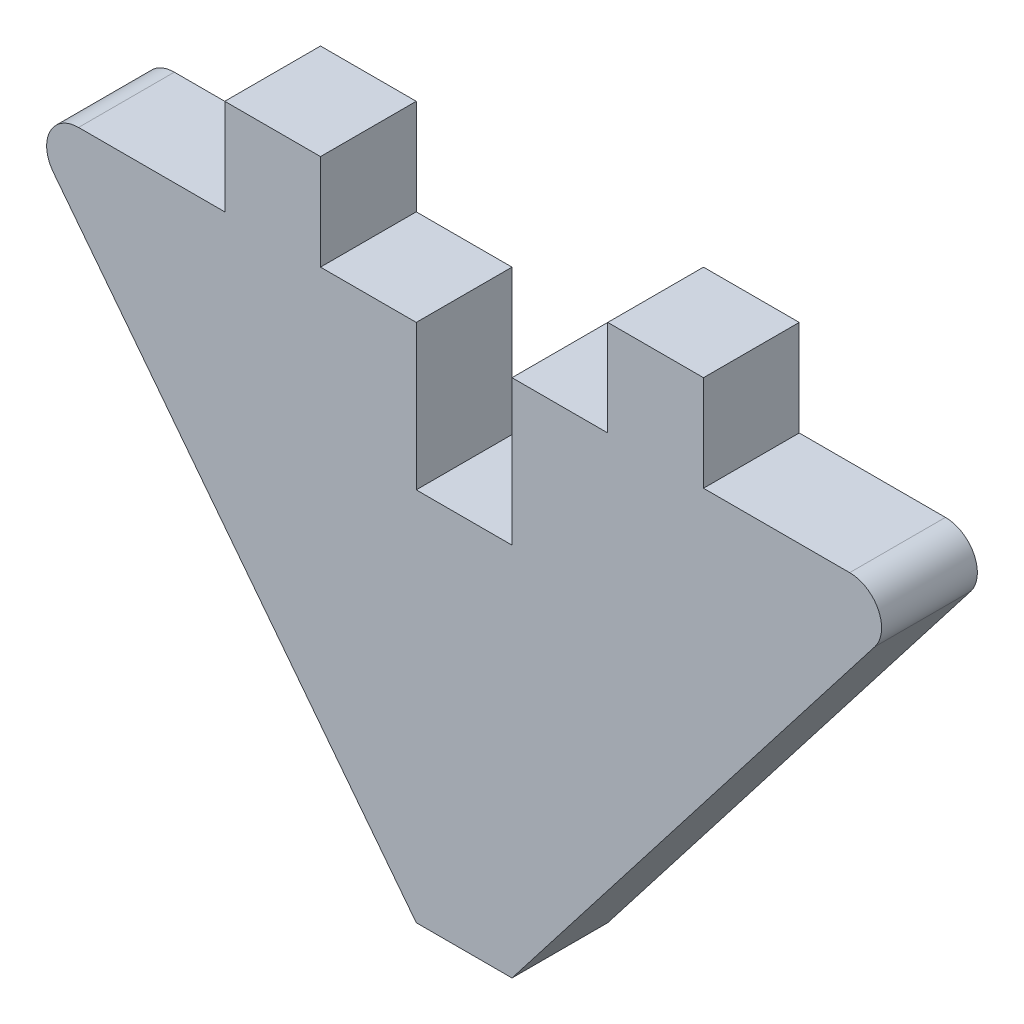
ISO-10303-21;
HEADER;
FILE_DESCRIPTION(('STEP AP214'),'2;1');
FILE_NAME('part.step','',(''),(''),'','','');
FILE_SCHEMA(('AUTOMOTIVE_DESIGN { 1 0 10303 214 1 1 1 1 }'));
ENDSEC;
DATA;
#1=APPLICATION_CONTEXT('core data for automotive mechanical design processes');
#2=APPLICATION_PROTOCOL_DEFINITION('international standard','automotive_design',2000,#1);
#3=PRODUCT_CONTEXT('',#1,'mechanical');
#4=PRODUCT('Part','Part','',(#3));
#5=PRODUCT_RELATED_PRODUCT_CATEGORY('part','',(#4));
#6=PRODUCT_DEFINITION_FORMATION('','',#4);
#7=PRODUCT_DEFINITION_CONTEXT('part definition',#1,'design');
#8=PRODUCT_DEFINITION('design','',#6,#7);
#9=PRODUCT_DEFINITION_SHAPE('','',#8);
#10=(LENGTH_UNIT() NAMED_UNIT(*) SI_UNIT(.MILLI.,.METRE.));
#11=(NAMED_UNIT(*) PLANE_ANGLE_UNIT() SI_UNIT($,.RADIAN.));
#12=(NAMED_UNIT(*) SI_UNIT($,.STERADIAN.) SOLID_ANGLE_UNIT());
#13=UNCERTAINTY_MEASURE_WITH_UNIT(LENGTH_MEASURE(1.E-05),#10,'distance_accuracy_value','');
#14=(GEOMETRIC_REPRESENTATION_CONTEXT(3) GLOBAL_UNCERTAINTY_ASSIGNED_CONTEXT((#13)) GLOBAL_UNIT_ASSIGNED_CONTEXT((#10,
#11,#12)) REPRESENTATION_CONTEXT('',''));
#15=CARTESIAN_POINT('',(0.,0.,0.));
#16=DIRECTION('',(0.,0.,1.));
#17=DIRECTION('',(1.,0.,0.));
#18=AXIS2_PLACEMENT_3D('',#15,#16,#17);
#19=CARTESIAN_POINT('',(1.524,62.1762102271489,1.524));
#20=DIRECTION('',(0.,-1.,0.));
#21=DIRECTION('',(0.,0.,-1.));
#22=AXIS2_PLACEMENT_3D('',#19,#20,#21);
#23=PLANE('',#22);
#24=DIRECTION('',(-1.,0.,0.));
#25=VECTOR('',#24,1.);
#26=CARTESIAN_POINT('',(1.524,62.1762102271489,0.));
#27=LINE('',#26,#25);
#28=CARTESIAN_POINT('',(1.524,62.1762102271489,0.));
#29=VERTEX_POINT('',#28);
#30=CARTESIAN_POINT('',(0.,62.1762102271489,0.));
#31=VERTEX_POINT('',#30);
#32=EDGE_CURVE('E188',#29,#31,#27,.T.);
#33=ORIENTED_EDGE('',*,*,#32,.T.);
#34=DIRECTION('',(0.,0.,-1.));
#35=VECTOR('',#34,1.);
#36=CARTESIAN_POINT('',(0.,62.1762102271489,1.524));
#37=LINE('',#36,#35);
#38=CARTESIAN_POINT('',(0.,62.1762102271489,1.524));
#39=VERTEX_POINT('',#38);
#40=EDGE_CURVE('E11',#39,#31,#37,.T.);
#41=ORIENTED_EDGE('',*,*,#40,.F.);
#42=DIRECTION('',(-1.,0.,0.));
#43=VECTOR('',#42,1.);
#44=CARTESIAN_POINT('',(1.524,62.1762102271489,1.524));
#45=LINE('',#44,#43);
#46=CARTESIAN_POINT('',(1.524,62.1762102271489,1.524));
#47=VERTEX_POINT('',#46);
#48=EDGE_CURVE('E222',#47,#39,#45,.T.);
#49=ORIENTED_EDGE('',*,*,#48,.F.);
#50=DIRECTION('',(0.,0.,-1.));
#51=VECTOR('',#50,1.);
#52=CARTESIAN_POINT('',(1.524,62.1762102271489,1.524));
#53=LINE('',#52,#51);
#54=EDGE_CURVE('E184',#47,#29,#53,.T.);
#55=ORIENTED_EDGE('',*,*,#54,.T.);
#56=EDGE_LOOP('',(#33,#41,#49,#55));
#57=FACE_BOUND('',#56,.T.);
#58=ADVANCED_FACE('F32',(#57),#23,.F.);
#59=CARTESIAN_POINT('',(0.,62.1762102271489,1.524));
#60=DIRECTION('',(-1.,0.,0.));
#61=DIRECTION('',(0.,0.,1.));
#62=AXIS2_PLACEMENT_3D('',#59,#60,#61);
#63=PLANE('',#62);
#64=DIRECTION('',(0.,1.,0.));
#65=VECTOR('',#64,1.);
#66=CARTESIAN_POINT('',(0.,62.1762102271489,0.));
#67=LINE('',#66,#65);
#68=CARTESIAN_POINT('',(0.,64.484455760315,0.));
#69=VERTEX_POINT('',#68);
#70=EDGE_CURVE('E191',#31,#69,#67,.T.);
#71=ORIENTED_EDGE('',*,*,#70,.T.);
#72=DIRECTION('',(0.,0.,-1.));
#73=VECTOR('',#72,1.);
#74=CARTESIAN_POINT('',(0.,64.484455760315,1.524));
#75=LINE('',#74,#73);
#76=CARTESIAN_POINT('',(0.,64.484455760315,1.524));
#77=VERTEX_POINT('',#76);
#78=EDGE_CURVE('E40',#77,#69,#75,.T.);
#79=ORIENTED_EDGE('',*,*,#78,.F.);
#80=DIRECTION('',(0.,1.,0.));
#81=VECTOR('',#80,1.);
#82=CARTESIAN_POINT('',(0.,62.1762102271489,1.524));
#83=LINE('',#82,#81);
#84=EDGE_CURVE('E121',#39,#77,#83,.T.);
#85=ORIENTED_EDGE('',*,*,#84,.F.);
#86=ORIENTED_EDGE('',*,*,#40,.T.);
#87=EDGE_LOOP('',(#71,#79,#85,#86));
#88=FACE_BOUND('',#87,.T.);
#89=ADVANCED_FACE('F330',(#88),#63,.F.);
#90=CARTESIAN_POINT('',(0.,64.484455760315,1.524));
#91=DIRECTION('',(0.,-1.,0.));
#92=DIRECTION('',(0.,0.,-1.));
#93=AXIS2_PLACEMENT_3D('',#90,#91,#92);
#94=PLANE('',#93);
#95=DIRECTION('',(-1.,0.,0.));
#96=VECTOR('',#95,1.);
#97=CARTESIAN_POINT('',(0.,64.484455760315,0.));
#98=LINE('',#97,#96);
#99=CARTESIAN_POINT('',(-1.524,64.484455760315,0.));
#100=VERTEX_POINT('',#99);
#101=EDGE_CURVE('E193',#69,#100,#98,.T.);
#102=ORIENTED_EDGE('',*,*,#101,.T.);
#103=DIRECTION('',(0.,0.,-1.));
#104=VECTOR('',#103,1.);
#105=CARTESIAN_POINT('',(-1.524,64.484455760315,1.524));
#106=LINE('',#105,#104);
#107=CARTESIAN_POINT('',(-1.524,64.484455760315,1.524));
#108=VERTEX_POINT('',#107);
#109=EDGE_CURVE('E259',#108,#100,#106,.T.);
#110=ORIENTED_EDGE('',*,*,#109,.F.);
#111=DIRECTION('',(-1.,0.,0.));
#112=VECTOR('',#111,1.);
#113=CARTESIAN_POINT('',(0.,64.484455760315,1.524));
#114=LINE('',#113,#112);
#115=EDGE_CURVE('E267',#77,#108,#114,.T.);
#116=ORIENTED_EDGE('',*,*,#115,.F.);
#117=ORIENTED_EDGE('',*,*,#78,.T.);
#118=EDGE_LOOP('',(#102,#110,#116,#117));
#119=FACE_BOUND('',#118,.T.);
#120=ADVANCED_FACE('F265',(#119),#94,.F.);
#121=CARTESIAN_POINT('',(-1.524,64.484455760315,1.524));
#122=DIRECTION('',(-1.,0.,0.));
#123=DIRECTION('',(0.,0.,1.));
#124=AXIS2_PLACEMENT_3D('',#121,#122,#123);
#125=PLANE('',#124);
#126=DIRECTION('',(0.,1.,0.));
#127=VECTOR('',#126,1.);
#128=CARTESIAN_POINT('',(-1.524,64.484455760315,0.));
#129=LINE('',#128,#127);
#130=CARTESIAN_POINT('',(-1.524,66.008455760315,0.));
#131=VERTEX_POINT('',#130);
#132=EDGE_CURVE('E195',#100,#131,#129,.T.);
#133=ORIENTED_EDGE('',*,*,#132,.T.);
#134=DIRECTION('',(0.,0.,-1.));
#135=VECTOR('',#134,1.);
#136=CARTESIAN_POINT('',(-1.524,66.008455760315,1.524));
#137=LINE('',#136,#135);
#138=CARTESIAN_POINT('',(-1.524,66.008455760315,1.524));
#139=VERTEX_POINT('',#138);
#140=EDGE_CURVE('E256',#139,#131,#137,.T.);
#141=ORIENTED_EDGE('',*,*,#140,.F.);
#142=DIRECTION('',(0.,1.,0.));
#143=VECTOR('',#142,1.);
#144=CARTESIAN_POINT('',(-1.524,64.484455760315,1.524));
#145=LINE('',#144,#143);
#146=EDGE_CURVE('E285',#108,#139,#145,.T.);
#147=ORIENTED_EDGE('',*,*,#146,.F.);
#148=ORIENTED_EDGE('',*,*,#109,.T.);
#149=EDGE_LOOP('',(#133,#141,#147,#148));
#150=FACE_BOUND('',#149,.T.);
#151=ADVANCED_FACE('F276',(#150),#125,.F.);
#152=CARTESIAN_POINT('',(-1.524,66.008455760315,1.524));
#153=DIRECTION('',(0.,-1.,0.));
#154=DIRECTION('',(0.,0.,-1.));
#155=AXIS2_PLACEMENT_3D('',#152,#153,#154);
#156=PLANE('',#155);
#157=DIRECTION('',(-1.,0.,0.));
#158=VECTOR('',#157,1.);
#159=CARTESIAN_POINT('',(-1.524,66.008455760315,0.));
#160=LINE('',#159,#158);
#161=CARTESIAN_POINT('',(-3.048,66.008455760315,0.));
#162=VERTEX_POINT('',#161);
#163=EDGE_CURVE('E197',#131,#162,#160,.T.);
#164=ORIENTED_EDGE('',*,*,#163,.T.);
#165=DIRECTION('',(0.,0.,-1.));
#166=VECTOR('',#165,1.);
#167=CARTESIAN_POINT('',(-3.048,66.008455760315,1.524));
#168=LINE('',#167,#166);
#169=CARTESIAN_POINT('',(-3.048,66.008455760315,1.524));
#170=VERTEX_POINT('',#169);
#171=EDGE_CURVE('E253',#170,#162,#168,.T.);
#172=ORIENTED_EDGE('',*,*,#171,.F.);
#173=DIRECTION('',(-1.,0.,0.));
#174=VECTOR('',#173,1.);
#175=CARTESIAN_POINT('',(-1.524,66.008455760315,1.524));
#176=LINE('',#175,#174);
#177=EDGE_CURVE('E282',#139,#170,#176,.T.);
#178=ORIENTED_EDGE('',*,*,#177,.F.);
#179=ORIENTED_EDGE('',*,*,#140,.T.);
#180=EDGE_LOOP('',(#164,#172,#178,#179));
#181=FACE_BOUND('',#180,.T.);
#182=ADVANCED_FACE('F280',(#181),#156,.F.);
#183=CARTESIAN_POINT('',(-3.048,66.008455760315,1.524));
#184=DIRECTION('',(1.,0.,0.));
#185=DIRECTION('',(0.,0.,-1.));
#186=AXIS2_PLACEMENT_3D('',#183,#184,#185);
#187=PLANE('',#186);
#188=DIRECTION('',(0.,-1.,0.));
#189=VECTOR('',#188,1.);
#190=CARTESIAN_POINT('',(-3.048,66.008455760315,0.));
#191=LINE('',#190,#189);
#192=CARTESIAN_POINT('',(-3.048,64.484455760315,0.));
#193=VERTEX_POINT('',#192);
#194=EDGE_CURVE('E199',#162,#193,#191,.T.);
#195=ORIENTED_EDGE('',*,*,#194,.T.);
#196=DIRECTION('',(0.,0.,-1.));
#197=VECTOR('',#196,1.);
#198=CARTESIAN_POINT('',(-3.048,64.484455760315,1.524));
#199=LINE('',#198,#197);
#200=CARTESIAN_POINT('',(-3.048,64.484455760315,1.524));
#201=VERTEX_POINT('',#200);
#202=EDGE_CURVE('E250',#201,#193,#199,.T.);
#203=ORIENTED_EDGE('',*,*,#202,.F.);
#204=DIRECTION('',(0.,-1.,0.));
#205=VECTOR('',#204,1.);
#206=CARTESIAN_POINT('',(-3.048,66.008455760315,1.524));
#207=LINE('',#206,#205);
#208=EDGE_CURVE('E284',#170,#201,#207,.T.);
#209=ORIENTED_EDGE('',*,*,#208,.F.);
#210=ORIENTED_EDGE('',*,*,#171,.T.);
#211=EDGE_LOOP('',(#195,#203,#209,#210));
#212=FACE_BOUND('',#211,.T.);
#213=ADVANCED_FACE('F343',(#212),#187,.F.);
#214=CARTESIAN_POINT('',(-3.048,64.484455760315,1.524));
#215=DIRECTION('',(0.,-1.,0.));
#216=DIRECTION('',(0.,0.,-1.));
#217=AXIS2_PLACEMENT_3D('',#214,#215,#216);
#218=PLANE('',#217);
#219=DIRECTION('',(-1.,0.,0.));
#220=VECTOR('',#219,1.);
#221=CARTESIAN_POINT('',(-3.048,64.484455760315,0.));
#222=LINE('',#221,#220);
#223=CARTESIAN_POINT('',(-5.37485688317024,64.484455760315,0.));
#224=VERTEX_POINT('',#223);
#225=EDGE_CURVE('E201',#193,#224,#222,.T.);
#226=ORIENTED_EDGE('',*,*,#225,.T.);
#227=DIRECTION('',(0.,0.,-1.));
#228=VECTOR('',#227,1.);
#229=CARTESIAN_POINT('',(-5.37485688317024,64.484455760315,1.524));
#230=LINE('',#229,#228);
#231=CARTESIAN_POINT('',(-5.37485688317024,64.484455760315,1.524));
#232=VERTEX_POINT('',#231);
#233=EDGE_CURVE('E247',#232,#224,#230,.T.);
#234=ORIENTED_EDGE('',*,*,#233,.F.);
#235=DIRECTION('',(-1.,0.,0.));
#236=VECTOR('',#235,1.);
#237=CARTESIAN_POINT('',(-3.048,64.484455760315,1.524));
#238=LINE('',#237,#236);
#239=EDGE_CURVE('E287',#201,#232,#238,.T.);
#240=ORIENTED_EDGE('',*,*,#239,.F.);
#241=ORIENTED_EDGE('',*,*,#202,.T.);
#242=EDGE_LOOP('',(#226,#234,#240,#241));
#243=FACE_BOUND('',#242,.T.);
#244=ADVANCED_FACE('F346',(#243),#218,.F.);
#245=CARTESIAN_POINT('',(-5.37485688317025,63.976455760315,1.524));
#246=DIRECTION('',(0.,0.,-1.));
#247=DIRECTION('',(-1.,0.,0.));
#248=AXIS2_PLACEMENT_3D('',#245,#246,#247);
#249=CYLINDRICAL_SURFACE('',#248,0.508);
#250=CARTESIAN_POINT('',(-5.37485688317025,63.976455760315,0.));
#251=DIRECTION('',(0.,0.,1.));
#252=DIRECTION('',(-1.,0.,0.));
#253=AXIS2_PLACEMENT_3D('',#250,#251,#252);
#254=CIRCLE('',#253,0.508);
#255=CARTESIAN_POINT('',(-5.77643338822377,63.6653282774579,0.));
#256=VERTEX_POINT('',#255);
#257=EDGE_CURVE('E203',#224,#256,#254,.T.);
#258=ORIENTED_EDGE('',*,*,#257,.T.);
#259=DIRECTION('',(0.,0.,-1.));
#260=VECTOR('',#259,1.);
#261=CARTESIAN_POINT('',(-5.77643338822377,63.6653282774579,1.524));
#262=LINE('',#261,#260);
#263=CARTESIAN_POINT('',(-5.77643338822377,63.6653282774579,1.524));
#264=VERTEX_POINT('',#263);
#265=EDGE_CURVE('E244',#264,#256,#262,.T.);
#266=ORIENTED_EDGE('',*,*,#265,.F.);
#267=CARTESIAN_POINT('',(-5.37485688317025,63.976455760315,1.524));
#268=DIRECTION('',(0.,0.,1.));
#269=DIRECTION('',(-1.,0.,0.));
#270=AXIS2_PLACEMENT_3D('',#267,#268,#269);
#271=CIRCLE('',#270,0.508);
#272=EDGE_CURVE('E293',#232,#264,#271,.T.);
#273=ORIENTED_EDGE('',*,*,#272,.F.);
#274=ORIENTED_EDGE('',*,*,#233,.T.);
#275=EDGE_LOOP('',(#258,#266,#273,#274));
#276=FACE_BOUND('',#275,.T.);
#277=ADVANCED_FACE('F350',(#276),#249,.T.);
#278=CARTESIAN_POINT('',(-5.77643338822377,63.6653282774579,1.524));
#279=DIRECTION('',(0.790504931207738,0.61245567491554,0.));
#280=DIRECTION('',(-0.61245567491554,0.790504931207738,0.));
#281=AXIS2_PLACEMENT_3D('',#278,#279,#280);
#282=PLANE('',#281);
#283=DIRECTION('',(0.61245567491554,-0.790504931207738,0.));
#284=VECTOR('',#283,1.);
#285=CARTESIAN_POINT('',(-5.77643338822377,63.6653282774579,0.));
#286=LINE('',#285,#284);
#287=CARTESIAN_POINT('',(0.,56.2096065571659,0.));
#288=VERTEX_POINT('',#287);
#289=EDGE_CURVE('E205',#256,#288,#286,.T.);
#290=ORIENTED_EDGE('',*,*,#289,.T.);
#291=DIRECTION('',(0.,0.,-1.));
#292=VECTOR('',#291,1.);
#293=CARTESIAN_POINT('',(0.,56.2096065571659,1.524));
#294=LINE('',#293,#292);
#295=CARTESIAN_POINT('',(0.,56.2096065571659,1.524));
#296=VERTEX_POINT('',#295);
#297=EDGE_CURVE('E241',#296,#288,#294,.T.);
#298=ORIENTED_EDGE('',*,*,#297,.F.);
#299=DIRECTION('',(0.61245567491554,-0.790504931207738,0.));
#300=VECTOR('',#299,1.);
#301=CARTESIAN_POINT('',(-5.77643338822377,63.6653282774579,1.524));
#302=LINE('',#301,#300);
#303=EDGE_CURVE('E295',#264,#296,#302,.T.);
#304=ORIENTED_EDGE('',*,*,#303,.F.);
#305=ORIENTED_EDGE('',*,*,#265,.T.);
#306=EDGE_LOOP('',(#290,#298,#304,#305));
#307=FACE_BOUND('',#306,.T.);
#308=ADVANCED_FACE('F354',(#307),#282,.F.);
#309=CARTESIAN_POINT('',(1.524,56.2096065571659,1.524));
#310=DIRECTION('',(0.,1.,0.));
#311=DIRECTION('',(0.,0.,1.));
#312=AXIS2_PLACEMENT_3D('',#309,#310,#311);
#313=PLANE('',#312);
#314=DIRECTION('',(1.,0.,0.));
#315=VECTOR('',#314,1.);
#316=CARTESIAN_POINT('',(1.524,56.2096065571659,0.));
#317=LINE('',#316,#315);
#318=CARTESIAN_POINT('',(1.524,56.2096065571659,0.));
#319=VERTEX_POINT('',#318);
#320=EDGE_CURVE('E207',#288,#319,#317,.T.);
#321=ORIENTED_EDGE('',*,*,#320,.T.);
#322=DIRECTION('',(0.,0.,-1.));
#323=VECTOR('',#322,1.);
#324=CARTESIAN_POINT('',(1.524,56.2096065571659,1.524));
#325=LINE('',#324,#323);
#326=CARTESIAN_POINT('',(1.524,56.2096065571659,1.524));
#327=VERTEX_POINT('',#326);
#328=EDGE_CURVE('E238',#327,#319,#325,.T.);
#329=ORIENTED_EDGE('',*,*,#328,.F.);
#330=DIRECTION('',(1.,0.,0.));
#331=VECTOR('',#330,1.);
#332=CARTESIAN_POINT('',(1.524,56.2096065571659,1.524));
#333=LINE('',#332,#331);
#334=EDGE_CURVE('E297',#296,#327,#333,.T.);
#335=ORIENTED_EDGE('',*,*,#334,.F.);
#336=ORIENTED_EDGE('',*,*,#297,.T.);
#337=EDGE_LOOP('',(#321,#329,#335,#336));
#338=FACE_BOUND('',#337,.T.);
#339=ADVANCED_FACE('F358',(#338),#313,.F.);
#340=CARTESIAN_POINT('',(7.30043338822377,63.6653282774579,1.524));
#341=DIRECTION('',(-0.790504931207738,0.61245567491554,0.));
#342=DIRECTION('',(-0.61245567491554,-0.790504931207738,0.));
#343=AXIS2_PLACEMENT_3D('',#340,#341,#342);
#344=PLANE('',#343);
#345=DIRECTION('',(0.61245567491554,0.790504931207738,0.));
#346=VECTOR('',#345,1.);
#347=CARTESIAN_POINT('',(7.30043338822377,63.6653282774579,0.));
#348=LINE('',#347,#346);
#349=CARTESIAN_POINT('',(7.30043338822377,63.6653282774579,0.));
#350=VERTEX_POINT('',#349);
#351=EDGE_CURVE('E209',#319,#350,#348,.T.);
#352=ORIENTED_EDGE('',*,*,#351,.T.);
#353=DIRECTION('',(0.,0.,-1.));
#354=VECTOR('',#353,1.);
#355=CARTESIAN_POINT('',(7.30043338822377,63.6653282774579,1.524));
#356=LINE('',#355,#354);
#357=CARTESIAN_POINT('',(7.30043338822377,63.6653282774579,1.524));
#358=VERTEX_POINT('',#357);
#359=EDGE_CURVE('E235',#358,#350,#356,.T.);
#360=ORIENTED_EDGE('',*,*,#359,.F.);
#361=DIRECTION('',(0.61245567491554,0.790504931207738,0.));
#362=VECTOR('',#361,1.);
#363=CARTESIAN_POINT('',(7.30043338822377,63.6653282774579,1.524));
#364=LINE('',#363,#362);
#365=EDGE_CURVE('E299',#327,#358,#364,.T.);
#366=ORIENTED_EDGE('',*,*,#365,.F.);
#367=ORIENTED_EDGE('',*,*,#328,.T.);
#368=EDGE_LOOP('',(#352,#360,#366,#367));
#369=FACE_BOUND('',#368,.T.);
#370=ADVANCED_FACE('F362',(#369),#344,.F.);
#371=CARTESIAN_POINT('',(6.89885688317025,63.976455760315,1.524));
#372=DIRECTION('',(0.,0.,-1.));
#373=DIRECTION('',(-1.,0.,0.));
#374=AXIS2_PLACEMENT_3D('',#371,#372,#373);
#375=CYLINDRICAL_SURFACE('',#374,0.508);
#376=CARTESIAN_POINT('',(6.89885688317025,63.976455760315,0.));
#377=DIRECTION('',(0.,0.,1.));
#378=DIRECTION('',(-1.,0.,0.));
#379=AXIS2_PLACEMENT_3D('',#376,#377,#378);
#380=CIRCLE('',#379,0.508);
#381=CARTESIAN_POINT('',(6.89885688317024,64.484455760315,0.));
#382=VERTEX_POINT('',#381);
#383=EDGE_CURVE('E211',#350,#382,#380,.T.);
#384=ORIENTED_EDGE('',*,*,#383,.T.);
#385=DIRECTION('',(0.,0.,-1.));
#386=VECTOR('',#385,1.);
#387=CARTESIAN_POINT('',(6.89885688317024,64.484455760315,1.524));
#388=LINE('',#387,#386);
#389=CARTESIAN_POINT('',(6.89885688317024,64.484455760315,1.524));
#390=VERTEX_POINT('',#389);
#391=EDGE_CURVE('E232',#390,#382,#388,.T.);
#392=ORIENTED_EDGE('',*,*,#391,.F.);
#393=CARTESIAN_POINT('',(6.89885688317025,63.976455760315,1.524));
#394=DIRECTION('',(0.,0.,1.));
#395=DIRECTION('',(-1.,0.,0.));
#396=AXIS2_PLACEMENT_3D('',#393,#394,#395);
#397=CIRCLE('',#396,0.508);
#398=EDGE_CURVE('E301',#358,#390,#397,.T.);
#399=ORIENTED_EDGE('',*,*,#398,.F.);
#400=ORIENTED_EDGE('',*,*,#359,.T.);
#401=EDGE_LOOP('',(#384,#392,#399,#400));
#402=FACE_BOUND('',#401,.T.);
#403=ADVANCED_FACE('F366',(#402),#375,.T.);
#404=CARTESIAN_POINT('',(4.572,64.484455760315,1.524));
#405=DIRECTION('',(0.,-1.,0.));
#406=DIRECTION('',(0.,0.,-1.));
#407=AXIS2_PLACEMENT_3D('',#404,#405,#406);
#408=PLANE('',#407);
#409=DIRECTION('',(-1.,0.,0.));
#410=VECTOR('',#409,1.);
#411=CARTESIAN_POINT('',(4.572,64.484455760315,0.));
#412=LINE('',#411,#410);
#413=CARTESIAN_POINT('',(4.572,64.484455760315,0.));
#414=VERTEX_POINT('',#413);
#415=EDGE_CURVE('E213',#382,#414,#412,.T.);
#416=ORIENTED_EDGE('',*,*,#415,.T.);
#417=DIRECTION('',(0.,0.,-1.));
#418=VECTOR('',#417,1.);
#419=CARTESIAN_POINT('',(4.572,64.484455760315,1.524));
#420=LINE('',#419,#418);
#421=CARTESIAN_POINT('',(4.572,64.484455760315,1.524));
#422=VERTEX_POINT('',#421);
#423=EDGE_CURVE('E229',#422,#414,#420,.T.);
#424=ORIENTED_EDGE('',*,*,#423,.F.);
#425=DIRECTION('',(-1.,0.,0.));
#426=VECTOR('',#425,1.);
#427=CARTESIAN_POINT('',(4.572,64.484455760315,1.524));
#428=LINE('',#427,#426);
#429=EDGE_CURVE('E303',#390,#422,#428,.T.);
#430=ORIENTED_EDGE('',*,*,#429,.F.);
#431=ORIENTED_EDGE('',*,*,#391,.T.);
#432=EDGE_LOOP('',(#416,#424,#430,#431));
#433=FACE_BOUND('',#432,.T.);
#434=ADVANCED_FACE('F370',(#433),#408,.F.);
#435=CARTESIAN_POINT('',(4.572,66.008455760315,1.524));
#436=DIRECTION('',(-1.,0.,0.));
#437=DIRECTION('',(0.,0.,1.));
#438=AXIS2_PLACEMENT_3D('',#435,#436,#437);
#439=PLANE('',#438);
#440=DIRECTION('',(0.,1.,0.));
#441=VECTOR('',#440,1.);
#442=CARTESIAN_POINT('',(4.572,66.008455760315,0.));
#443=LINE('',#442,#441);
#444=CARTESIAN_POINT('',(4.572,66.008455760315,0.));
#445=VERTEX_POINT('',#444);
#446=EDGE_CURVE('E215',#414,#445,#443,.T.);
#447=ORIENTED_EDGE('',*,*,#446,.T.);
#448=DIRECTION('',(0.,0.,-1.));
#449=VECTOR('',#448,1.);
#450=CARTESIAN_POINT('',(4.572,66.008455760315,1.524));
#451=LINE('',#450,#449);
#452=CARTESIAN_POINT('',(4.572,66.008455760315,1.524));
#453=VERTEX_POINT('',#452);
#454=EDGE_CURVE('E226',#453,#445,#451,.T.);
#455=ORIENTED_EDGE('',*,*,#454,.F.);
#456=DIRECTION('',(0.,1.,0.));
#457=VECTOR('',#456,1.);
#458=CARTESIAN_POINT('',(4.572,66.008455760315,1.524));
#459=LINE('',#458,#457);
#460=EDGE_CURVE('E305',#422,#453,#459,.T.);
#461=ORIENTED_EDGE('',*,*,#460,.F.);
#462=ORIENTED_EDGE('',*,*,#423,.T.);
#463=EDGE_LOOP('',(#447,#455,#461,#462));
#464=FACE_BOUND('',#463,.T.);
#465=ADVANCED_FACE('F311',(#464),#439,.F.);
#466=CARTESIAN_POINT('',(3.048,66.008455760315,1.524));
#467=DIRECTION('',(0.,-1.,0.));
#468=DIRECTION('',(0.,0.,-1.));
#469=AXIS2_PLACEMENT_3D('',#466,#467,#468);
#470=PLANE('',#469);
#471=DIRECTION('',(-1.,0.,0.));
#472=VECTOR('',#471,1.);
#473=CARTESIAN_POINT('',(3.048,66.008455760315,0.));
#474=LINE('',#473,#472);
#475=CARTESIAN_POINT('',(3.048,66.008455760315,0.));
#476=VERTEX_POINT('',#475);
#477=EDGE_CURVE('E217',#445,#476,#474,.T.);
#478=ORIENTED_EDGE('',*,*,#477,.T.);
#479=DIRECTION('',(0.,0.,-1.));
#480=VECTOR('',#479,1.);
#481=CARTESIAN_POINT('',(3.048,66.008455760315,1.524));
#482=LINE('',#481,#480);
#483=CARTESIAN_POINT('',(3.048,66.008455760315,1.524));
#484=VERTEX_POINT('',#483);
#485=EDGE_CURVE('E179',#484,#476,#482,.T.);
#486=ORIENTED_EDGE('',*,*,#485,.F.);
#487=DIRECTION('',(-1.,0.,0.));
#488=VECTOR('',#487,1.);
#489=CARTESIAN_POINT('',(3.048,66.008455760315,1.524));
#490=LINE('',#489,#488);
#491=EDGE_CURVE('E170',#453,#484,#490,.T.);
#492=ORIENTED_EDGE('',*,*,#491,.F.);
#493=ORIENTED_EDGE('',*,*,#454,.T.);
#494=EDGE_LOOP('',(#478,#486,#492,#493));
#495=FACE_BOUND('',#494,.T.);
#496=ADVANCED_FACE('F315',(#495),#470,.F.);
#497=CARTESIAN_POINT('',(3.048,64.484455760315,1.524));
#498=DIRECTION('',(1.,0.,0.));
#499=DIRECTION('',(0.,0.,-1.));
#500=AXIS2_PLACEMENT_3D('',#497,#498,#499);
#501=PLANE('',#500);
#502=DIRECTION('',(0.,-1.,0.));
#503=VECTOR('',#502,1.);
#504=CARTESIAN_POINT('',(3.048,64.484455760315,0.));
#505=LINE('',#504,#503);
#506=CARTESIAN_POINT('',(3.048,64.484455760315,0.));
#507=VERTEX_POINT('',#506);
#508=EDGE_CURVE('E178',#476,#507,#505,.T.);
#509=ORIENTED_EDGE('',*,*,#508,.T.);
#510=DIRECTION('',(0.,0.,-1.));
#511=VECTOR('',#510,1.);
#512=CARTESIAN_POINT('',(3.048,64.484455760315,1.524));
#513=LINE('',#512,#511);
#514=CARTESIAN_POINT('',(3.048,64.484455760315,1.524));
#515=VERTEX_POINT('',#514);
#516=EDGE_CURVE('E175',#515,#507,#513,.T.);
#517=ORIENTED_EDGE('',*,*,#516,.F.);
#518=DIRECTION('',(0.,-1.,0.));
#519=VECTOR('',#518,1.);
#520=CARTESIAN_POINT('',(3.048,64.484455760315,1.524));
#521=LINE('',#520,#519);
#522=EDGE_CURVE('E164',#484,#515,#521,.T.);
#523=ORIENTED_EDGE('',*,*,#522,.F.);
#524=ORIENTED_EDGE('',*,*,#485,.T.);
#525=EDGE_LOOP('',(#509,#517,#523,#524));
#526=FACE_BOUND('',#525,.T.);
#527=ADVANCED_FACE('F176',(#526),#501,.F.);
#528=CARTESIAN_POINT('',(1.524,64.484455760315,1.524));
#529=DIRECTION('',(0.,-1.,0.));
#530=DIRECTION('',(0.,0.,-1.));
#531=AXIS2_PLACEMENT_3D('',#528,#529,#530);
#532=PLANE('',#531);
#533=DIRECTION('',(-1.,0.,0.));
#534=VECTOR('',#533,1.);
#535=CARTESIAN_POINT('',(1.524,64.484455760315,0.));
#536=LINE('',#535,#534);
#537=CARTESIAN_POINT('',(1.524,64.484455760315,0.));
#538=VERTEX_POINT('',#537);
#539=EDGE_CURVE('E107',#507,#538,#536,.T.);
#540=ORIENTED_EDGE('',*,*,#539,.T.);
#541=DIRECTION('',(0.,0.,-1.));
#542=VECTOR('',#541,1.);
#543=CARTESIAN_POINT('',(1.524,64.484455760315,1.524));
#544=LINE('',#543,#542);
#545=CARTESIAN_POINT('',(1.524,64.484455760315,1.524));
#546=VERTEX_POINT('',#545);
#547=EDGE_CURVE('E180',#546,#538,#544,.T.);
#548=ORIENTED_EDGE('',*,*,#547,.F.);
#549=DIRECTION('',(-1.,0.,0.));
#550=VECTOR('',#549,1.);
#551=CARTESIAN_POINT('',(1.524,64.484455760315,1.524));
#552=LINE('',#551,#550);
#553=EDGE_CURVE('E168',#515,#546,#552,.T.);
#554=ORIENTED_EDGE('',*,*,#553,.F.);
#555=ORIENTED_EDGE('',*,*,#516,.T.);
#556=EDGE_LOOP('',(#540,#548,#554,#555));
#557=FACE_BOUND('',#556,.T.);
#558=ADVANCED_FACE('F182',(#557),#532,.F.);
#559=CARTESIAN_POINT('',(1.524,62.1762102271489,1.524));
#560=DIRECTION('',(1.,0.,0.));
#561=DIRECTION('',(0.,0.,-1.));
#562=AXIS2_PLACEMENT_3D('',#559,#560,#561);
#563=PLANE('',#562);
#564=DIRECTION('',(0.,-1.,0.));
#565=VECTOR('',#564,1.);
#566=CARTESIAN_POINT('',(1.524,62.1762102271489,0.));
#567=LINE('',#566,#565);
#568=EDGE_CURVE('E113',#538,#29,#567,.T.);
#569=ORIENTED_EDGE('',*,*,#568,.T.);
#570=ORIENTED_EDGE('',*,*,#54,.F.);
#571=DIRECTION('',(0.,-1.,0.));
#572=VECTOR('',#571,1.);
#573=CARTESIAN_POINT('',(1.524,62.1762102271489,1.524));
#574=LINE('',#573,#572);
#575=EDGE_CURVE('E48',#546,#47,#574,.T.);
#576=ORIENTED_EDGE('',*,*,#575,.F.);
#577=ORIENTED_EDGE('',*,*,#547,.T.);
#578=EDGE_LOOP('',(#569,#570,#576,#577));
#579=FACE_BOUND('',#578,.T.);
#580=ADVANCED_FACE('F319',(#579),#563,.F.);
#581=CARTESIAN_POINT('',(-5.37485688317025,63.976455760315,1.524));
#582=DIRECTION('',(0.,0.,-1.));
#583=DIRECTION('',(-1.,0.,0.));
#584=AXIS2_PLACEMENT_3D('',#581,#582,#583);
#585=PLANE('',#584);
#586=ORIENTED_EDGE('',*,*,#48,.T.);
#587=ORIENTED_EDGE('',*,*,#84,.T.);
#588=ORIENTED_EDGE('',*,*,#115,.T.);
#589=ORIENTED_EDGE('',*,*,#146,.T.);
#590=ORIENTED_EDGE('',*,*,#177,.T.);
#591=ORIENTED_EDGE('',*,*,#208,.T.);
#592=ORIENTED_EDGE('',*,*,#239,.T.);
#593=ORIENTED_EDGE('',*,*,#272,.T.);
#594=ORIENTED_EDGE('',*,*,#303,.T.);
#595=ORIENTED_EDGE('',*,*,#334,.T.);
#596=ORIENTED_EDGE('',*,*,#365,.T.);
#597=ORIENTED_EDGE('',*,*,#398,.T.);
#598=ORIENTED_EDGE('',*,*,#429,.T.);
#599=ORIENTED_EDGE('',*,*,#460,.T.);
#600=ORIENTED_EDGE('',*,*,#491,.T.);
#601=ORIENTED_EDGE('',*,*,#522,.T.);
#602=ORIENTED_EDGE('',*,*,#553,.T.);
#603=ORIENTED_EDGE('',*,*,#575,.T.);
#604=EDGE_LOOP('',(#586,#587,#588,#589,#590,#591,#592,#593,#594,#595,#596,#597,#598,#599,#600,
#601,#602,#603));
#605=FACE_BOUND('',#604,.T.);
#606=ADVANCED_FACE('F166',(#605),#585,.F.);
#607=CARTESIAN_POINT('',(-5.37485688317025,63.976455760315,0.));
#608=DIRECTION('',(0.,0.,-1.));
#609=DIRECTION('',(-1.,0.,0.));
#610=AXIS2_PLACEMENT_3D('',#607,#608,#609);
#611=PLANE('',#610);
#612=ORIENTED_EDGE('',*,*,#32,.F.);
#613=ORIENTED_EDGE('',*,*,#568,.F.);
#614=ORIENTED_EDGE('',*,*,#539,.F.);
#615=ORIENTED_EDGE('',*,*,#508,.F.);
#616=ORIENTED_EDGE('',*,*,#477,.F.);
#617=ORIENTED_EDGE('',*,*,#446,.F.);
#618=ORIENTED_EDGE('',*,*,#415,.F.);
#619=ORIENTED_EDGE('',*,*,#383,.F.);
#620=ORIENTED_EDGE('',*,*,#351,.F.);
#621=ORIENTED_EDGE('',*,*,#320,.F.);
#622=ORIENTED_EDGE('',*,*,#289,.F.);
#623=ORIENTED_EDGE('',*,*,#257,.F.);
#624=ORIENTED_EDGE('',*,*,#225,.F.);
#625=ORIENTED_EDGE('',*,*,#194,.F.);
#626=ORIENTED_EDGE('',*,*,#163,.F.);
#627=ORIENTED_EDGE('',*,*,#132,.F.);
#628=ORIENTED_EDGE('',*,*,#101,.F.);
#629=ORIENTED_EDGE('',*,*,#70,.F.);
#630=EDGE_LOOP('',(#612,#613,#614,#615,#616,#617,#618,#619,#620,#621,#622,#623,#624,#625,#626,
#627,#628,#629));
#631=FACE_BOUND('',#630,.T.);
#632=ADVANCED_FACE('F271',(#631),#611,.T.);
#633=CLOSED_SHELL('',(#58,#89,#120,#151,#182,#213,#244,#277,#308,#339,#370,#403,#434,#465,#496,
#527,#558,#580,#606,#632));
#634=MANIFOLD_SOLID_BREP('B2',#633);
#635=ADVANCED_BREP_SHAPE_REPRESENTATION('',(#18,#634),#14);
#636=SHAPE_DEFINITION_REPRESENTATION(#9,#635);
ENDSEC;
END-ISO-10303-21;
